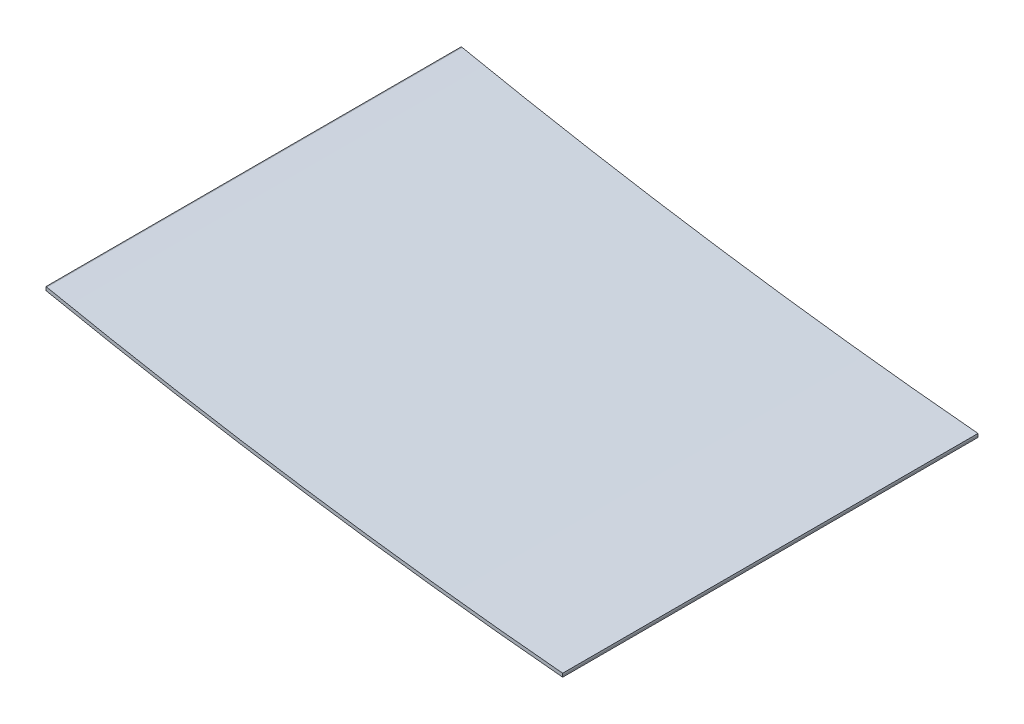
ISO-10303-21;
HEADER;
FILE_DESCRIPTION(('STEP AP214'),'2;1');
FILE_NAME('part.step','',(''),(''),'','','');
FILE_SCHEMA(('AUTOMOTIVE_DESIGN { 1 0 10303 214 1 1 1 1 }'));
ENDSEC;
DATA;
#1=APPLICATION_CONTEXT('core data for automotive mechanical design processes');
#2=APPLICATION_PROTOCOL_DEFINITION('international standard','automotive_design',2000,#1);
#3=PRODUCT_CONTEXT('',#1,'mechanical');
#4=PRODUCT('Part','Part','',(#3));
#5=PRODUCT_RELATED_PRODUCT_CATEGORY('part','',(#4));
#6=PRODUCT_DEFINITION_FORMATION('','',#4);
#7=PRODUCT_DEFINITION_CONTEXT('part definition',#1,'design');
#8=PRODUCT_DEFINITION('design','',#6,#7);
#9=PRODUCT_DEFINITION_SHAPE('','',#8);
#10=(LENGTH_UNIT() NAMED_UNIT(*) SI_UNIT(.MILLI.,.METRE.));
#11=(NAMED_UNIT(*) PLANE_ANGLE_UNIT() SI_UNIT($,.RADIAN.));
#12=(NAMED_UNIT(*) SI_UNIT($,.STERADIAN.) SOLID_ANGLE_UNIT());
#13=UNCERTAINTY_MEASURE_WITH_UNIT(LENGTH_MEASURE(1.E-05),#10,'distance_accuracy_value','');
#14=(GEOMETRIC_REPRESENTATION_CONTEXT(3) GLOBAL_UNCERTAINTY_ASSIGNED_CONTEXT((#13)) GLOBAL_UNIT_ASSIGNED_CONTEXT((#10,
#11,#12)) REPRESENTATION_CONTEXT('',''));
#15=CARTESIAN_POINT('',(0.,0.,0.));
#16=DIRECTION('',(0.,0.,1.));
#17=DIRECTION('',(1.,0.,0.));
#18=AXIS2_PLACEMENT_3D('',#15,#16,#17);
#19=CARTESIAN_POINT('',(8671.1802481074,-15050.6764409902,600.));
#20=DIRECTION('',(-0.999999638927628,0.000849790923044187,0.));
#21=DIRECTION('',(-0.000849790923044187,-0.999999638927629,0.));
#22=AXIS2_PLACEMENT_3D('',#19,#20,#21);
#23=PLANE('',#22);
#24=DIRECTION('',(0.000849790923044187,0.999999638927628,0.));
#25=VECTOR('',#24,1.);
#26=CARTESIAN_POINT('',(8671.1802481074,-15050.6764409902,0.));
#27=LINE('',#26,#25);
#28=CARTESIAN_POINT('',(8671.17862100654,-15052.591147568,0.));
#29=VERTEX_POINT('',#28);
#30=CARTESIAN_POINT('',(8671.1802481074,-15050.6764409902,0.));
#31=VERTEX_POINT('',#30);
#32=EDGE_CURVE('E118',#29,#31,#27,.T.);
#33=ORIENTED_EDGE('',*,*,#32,.T.);
#34=DIRECTION('',(0.,0.,-1.));
#35=VECTOR('',#34,1.);
#36=CARTESIAN_POINT('',(8671.1802481074,-15050.6764409902,600.));
#37=LINE('',#36,#35);
#38=CARTESIAN_POINT('',(8671.1802481074,-15050.6764409902,600.));
#39=VERTEX_POINT('',#38);
#40=EDGE_CURVE('E11',#39,#31,#37,.T.);
#41=ORIENTED_EDGE('',*,*,#40,.F.);
#42=DIRECTION('',(0.000849790923044187,0.999999638927628,0.));
#43=VECTOR('',#42,1.);
#44=CARTESIAN_POINT('',(8671.1802481074,-15050.6764409902,600.));
#45=LINE('',#44,#43);
#46=CARTESIAN_POINT('',(8671.17862100654,-15052.591147568,600.));
#47=VERTEX_POINT('',#46);
#48=EDGE_CURVE('E128',#47,#39,#45,.T.);
#49=ORIENTED_EDGE('',*,*,#48,.F.);
#50=DIRECTION('',(0.,0.,-1.));
#51=VECTOR('',#50,1.);
#52=CARTESIAN_POINT('',(8671.17862100654,-15052.591147568,600.));
#53=LINE('',#52,#51);
#54=EDGE_CURVE('E114',#47,#29,#53,.T.);
#55=ORIENTED_EDGE('',*,*,#54,.T.);
#56=EDGE_LOOP('',(#33,#41,#49,#55));
#57=FACE_BOUND('',#56,.T.);
#58=ADVANCED_FACE('F34',(#57),#23,.F.);
#59=CARTESIAN_POINT('',(8671.1802481074,-15050.6764409902,600.));
#60=DIRECTION('',(-1.,0.,0.));
#61=DIRECTION('',(0.,0.,1.));
#62=AXIS2_PLACEMENT_3D('',#59,#60,#61);
#63=PLANE('',#62);
#64=DIRECTION('',(0.,1.,0.));
#65=VECTOR('',#64,1.);
#66=CARTESIAN_POINT('',(8671.1802481074,-15050.6764409902,0.));
#67=LINE('',#66,#65);
#68=CARTESIAN_POINT('',(8671.1802481074,-15047.5702915107,0.));
#69=VERTEX_POINT('',#68);
#70=EDGE_CURVE('E121',#31,#69,#67,.T.);
#71=ORIENTED_EDGE('',*,*,#70,.T.);
#72=DIRECTION('',(0.,0.,-1.));
#73=VECTOR('',#72,1.);
#74=CARTESIAN_POINT('',(8671.1802481074,-15047.5702915107,600.));
#75=LINE('',#74,#73);
#76=CARTESIAN_POINT('',(8671.1802481074,-15047.5702915107,600.));
#77=VERTEX_POINT('',#76);
#78=EDGE_CURVE('E42',#77,#69,#75,.T.);
#79=ORIENTED_EDGE('',*,*,#78,.F.);
#80=DIRECTION('',(0.,1.,0.));
#81=VECTOR('',#80,1.);
#82=CARTESIAN_POINT('',(8671.1802481074,-15050.6764409902,600.));
#83=LINE('',#82,#81);
#84=EDGE_CURVE('E87',#39,#77,#83,.T.);
#85=ORIENTED_EDGE('',*,*,#84,.F.);
#86=ORIENTED_EDGE('',*,*,#40,.T.);
#87=EDGE_LOOP('',(#71,#79,#85,#86));
#88=FACE_BOUND('',#87,.T.);
#89=ADVANCED_FACE('F152',(#88),#63,.F.);
#90=CARTESIAN_POINT('',(9292.57518197892,-8278.07045923133,600.));
#91=DIRECTION('',(0.,0.,-1.));
#92=DIRECTION('',(-1.,0.,0.));
#93=AXIS2_PLACEMENT_3D('',#90,#91,#92);
#94=CYLINDRICAL_SURFACE('',#93,6797.95996186147);
#95=CARTESIAN_POINT('',(9292.57518197892,-8278.07045923133,0.));
#96=DIRECTION('',(0.,0.,-1.));
#97=DIRECTION('',(1.,0.,0.));
#98=AXIS2_PLACEMENT_3D('',#95,#96,#97);
#99=CIRCLE('',#98,6797.95996186147);
#100=CARTESIAN_POINT('',(7925.80352544643,-14937.2141640909,0.));
#101=VERTEX_POINT('',#100);
#102=EDGE_CURVE('E123',#69,#101,#99,.T.);
#103=ORIENTED_EDGE('',*,*,#102,.T.);
#104=DIRECTION('',(0.,0.,-1.));
#105=VECTOR('',#104,1.);
#106=CARTESIAN_POINT('',(7925.80352544643,-14937.2141640909,600.));
#107=LINE('',#106,#105);
#108=CARTESIAN_POINT('',(7925.80352544643,-14937.2141640909,600.));
#109=VERTEX_POINT('',#108);
#110=EDGE_CURVE('E109',#109,#101,#107,.T.);
#111=ORIENTED_EDGE('',*,*,#110,.F.);
#112=CARTESIAN_POINT('',(9292.57518197892,-8278.07045923133,600.));
#113=DIRECTION('',(0.,0.,-1.));
#114=DIRECTION('',(1.,0.,0.));
#115=AXIS2_PLACEMENT_3D('',#112,#113,#114);
#116=CIRCLE('',#115,6797.95996186147);
#117=EDGE_CURVE('E100',#77,#109,#116,.T.);
#118=ORIENTED_EDGE('',*,*,#117,.F.);
#119=ORIENTED_EDGE('',*,*,#78,.T.);
#120=EDGE_LOOP('',(#103,#111,#118,#119));
#121=FACE_BOUND('',#120,.T.);
#122=ADVANCED_FACE('F134',(#121),#94,.F.);
#123=CARTESIAN_POINT('',(7925.80352544643,-14937.2141640909,600.));
#124=DIRECTION('',(-0.20113009027345,-0.979564539367669,0.));
#125=DIRECTION('',(0.979564539367669,-0.20113009027345,0.));
#126=AXIS2_PLACEMENT_3D('',#123,#124,#125);
#127=PLANE('',#126);
#128=DIRECTION('',(-0.979564539367669,0.20113009027345,0.));
#129=VECTOR('',#128,1.);
#130=CARTESIAN_POINT('',(7925.80352544643,-14937.2141640909,0.));
#131=LINE('',#130,#129);
#132=CARTESIAN_POINT('',(7924.79824469736,-14937.0077537936,0.));
#133=VERTEX_POINT('',#132);
#134=EDGE_CURVE('E108',#101,#133,#131,.T.);
#135=ORIENTED_EDGE('',*,*,#134,.T.);
#136=DIRECTION('',(0.,0.,-1.));
#137=VECTOR('',#136,1.);
#138=CARTESIAN_POINT('',(7924.79824469736,-14937.0077537936,600.));
#139=LINE('',#138,#137);
#140=CARTESIAN_POINT('',(7924.79824469736,-14937.0077537936,600.));
#141=VERTEX_POINT('',#140);
#142=EDGE_CURVE('E105',#141,#133,#139,.T.);
#143=ORIENTED_EDGE('',*,*,#142,.F.);
#144=DIRECTION('',(-0.979564539367669,0.20113009027345,0.));
#145=VECTOR('',#144,1.);
#146=CARTESIAN_POINT('',(7925.80352544643,-14937.2141640909,600.));
#147=LINE('',#146,#145);
#148=EDGE_CURVE('E94',#109,#141,#147,.T.);
#149=ORIENTED_EDGE('',*,*,#148,.F.);
#150=ORIENTED_EDGE('',*,*,#110,.T.);
#151=EDGE_LOOP('',(#135,#143,#149,#150));
#152=FACE_BOUND('',#151,.T.);
#153=ADVANCED_FACE('F106',(#152),#127,.F.);
#154=CARTESIAN_POINT('',(7924.79824469736,-14937.0077537936,600.));
#155=DIRECTION('',(1.,0.,0.));
#156=DIRECTION('',(0.,0.,-1.));
#157=AXIS2_PLACEMENT_3D('',#154,#155,#156);
#158=PLANE('',#157);
#159=DIRECTION('',(0.,-1.,0.));
#160=VECTOR('',#159,1.);
#161=CARTESIAN_POINT('',(7924.79824469736,-14937.0077537936,0.));
#162=LINE('',#161,#160);
#163=CARTESIAN_POINT('',(7924.79824469736,-14942.1120626827,0.));
#164=VERTEX_POINT('',#163);
#165=EDGE_CURVE('E73',#133,#164,#162,.T.);
#166=ORIENTED_EDGE('',*,*,#165,.T.);
#167=DIRECTION('',(0.,0.,-1.));
#168=VECTOR('',#167,1.);
#169=CARTESIAN_POINT('',(7924.79824469736,-14942.1120626827,600.));
#170=LINE('',#169,#168);
#171=CARTESIAN_POINT('',(7924.79824469736,-14942.1120626827,600.));
#172=VERTEX_POINT('',#171);
#173=EDGE_CURVE('E110',#172,#164,#170,.T.);
#174=ORIENTED_EDGE('',*,*,#173,.F.);
#175=DIRECTION('',(0.,-1.,0.));
#176=VECTOR('',#175,1.);
#177=CARTESIAN_POINT('',(7924.79824469736,-14937.0077537936,600.));
#178=LINE('',#177,#176);
#179=EDGE_CURVE('E98',#141,#172,#178,.T.);
#180=ORIENTED_EDGE('',*,*,#179,.F.);
#181=ORIENTED_EDGE('',*,*,#142,.T.);
#182=EDGE_LOOP('',(#166,#174,#180,#181));
#183=FACE_BOUND('',#182,.T.);
#184=ADVANCED_FACE('F112',(#183),#158,.F.);
#185=CARTESIAN_POINT('',(9292.57518197892,-8278.07045923133,600.));
#186=DIRECTION('',(0.,0.,-1.));
#187=DIRECTION('',(-1.,0.,0.));
#188=AXIS2_PLACEMENT_3D('',#185,#186,#187);
#189=CYLINDRICAL_SURFACE('',#188,6802.95996186147);
#190=CARTESIAN_POINT('',(9292.57518197892,-8278.07045923133,0.));
#191=DIRECTION('',(0.,0.,1.));
#192=DIRECTION('',(1.,0.,0.));
#193=AXIS2_PLACEMENT_3D('',#190,#191,#192);
#194=CIRCLE('',#193,6802.95996186147);
#195=EDGE_CURVE('E79',#164,#29,#194,.T.);
#196=ORIENTED_EDGE('',*,*,#195,.T.);
#197=ORIENTED_EDGE('',*,*,#54,.F.);
#198=CARTESIAN_POINT('',(9292.57518197892,-8278.07045923133,600.));
#199=DIRECTION('',(0.,0.,1.));
#200=DIRECTION('',(1.,0.,0.));
#201=AXIS2_PLACEMENT_3D('',#198,#199,#200);
#202=CIRCLE('',#201,6802.95996186147);
#203=EDGE_CURVE('E50',#172,#47,#202,.T.);
#204=ORIENTED_EDGE('',*,*,#203,.F.);
#205=ORIENTED_EDGE('',*,*,#173,.T.);
#206=EDGE_LOOP('',(#196,#197,#204,#205));
#207=FACE_BOUND('',#206,.T.);
#208=ADVANCED_FACE('F141',(#207),#189,.T.);
#209=CARTESIAN_POINT('',(9292.57518197892,-8278.07045923133,600.));
#210=DIRECTION('',(0.,0.,1.));
#211=DIRECTION('',(1.,0.,0.));
#212=AXIS2_PLACEMENT_3D('',#209,#210,#211);
#213=PLANE('',#212);
#214=ORIENTED_EDGE('',*,*,#48,.T.);
#215=ORIENTED_EDGE('',*,*,#84,.T.);
#216=ORIENTED_EDGE('',*,*,#117,.T.);
#217=ORIENTED_EDGE('',*,*,#148,.T.);
#218=ORIENTED_EDGE('',*,*,#179,.T.);
#219=ORIENTED_EDGE('',*,*,#203,.T.);
#220=EDGE_LOOP('',(#214,#215,#216,#217,#218,#219));
#221=FACE_BOUND('',#220,.T.);
#222=ADVANCED_FACE('F96',(#221),#213,.T.);
#223=CARTESIAN_POINT('',(9292.57518197892,-8278.07045923133,0.));
#224=DIRECTION('',(0.,0.,1.));
#225=DIRECTION('',(1.,0.,0.));
#226=AXIS2_PLACEMENT_3D('',#223,#224,#225);
#227=PLANE('',#226);
#228=ORIENTED_EDGE('',*,*,#32,.F.);
#229=ORIENTED_EDGE('',*,*,#195,.F.);
#230=ORIENTED_EDGE('',*,*,#165,.F.);
#231=ORIENTED_EDGE('',*,*,#134,.F.);
#232=ORIENTED_EDGE('',*,*,#102,.F.);
#233=ORIENTED_EDGE('',*,*,#70,.F.);
#234=EDGE_LOOP('',(#228,#229,#230,#231,#232,#233));
#235=FACE_BOUND('',#234,.T.);
#236=ADVANCED_FACE('F137',(#235),#227,.F.);
#237=CLOSED_SHELL('',(#58,#89,#122,#153,#184,#208,#222,#236));
#238=MANIFOLD_SOLID_BREP('B2',#237);
#239=ADVANCED_BREP_SHAPE_REPRESENTATION('',(#18,#238),#14);
#240=SHAPE_DEFINITION_REPRESENTATION(#9,#239);
ENDSEC;
END-ISO-10303-21;
